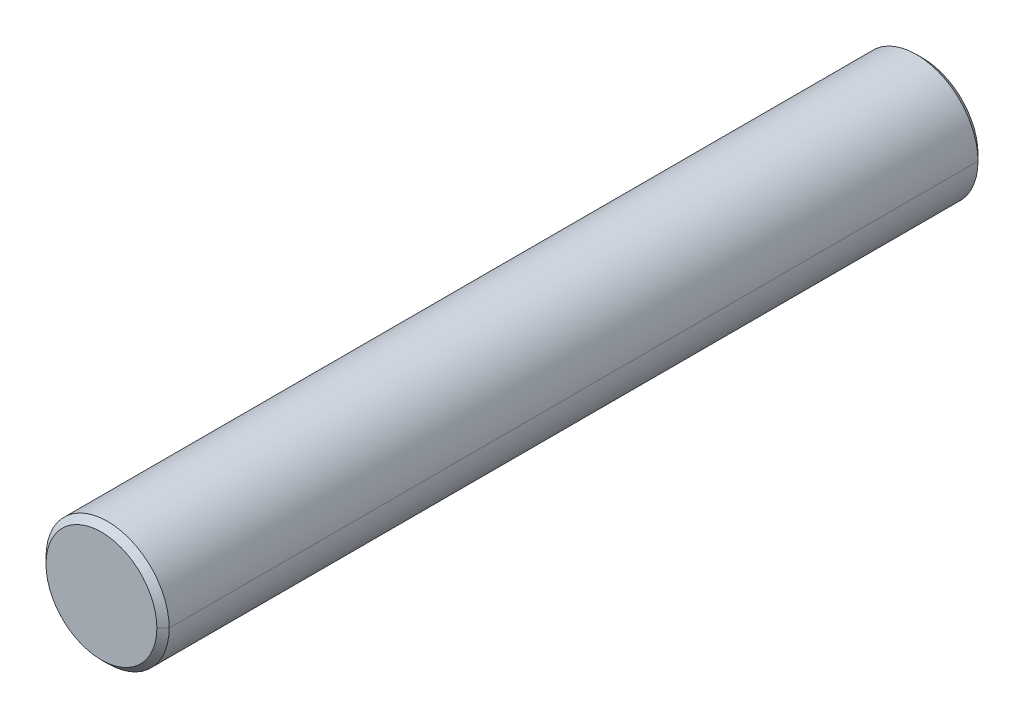
ISO-10303-21;
HEADER;
FILE_DESCRIPTION(('STEP AP214'),'2;1');
FILE_NAME('part.step','',(''),(''),'','','');
FILE_SCHEMA(('AUTOMOTIVE_DESIGN { 1 0 10303 214 1 1 1 1 }'));
ENDSEC;
DATA;
#1=APPLICATION_CONTEXT('core data for automotive mechanical design processes');
#2=APPLICATION_PROTOCOL_DEFINITION('international standard','automotive_design',2000,#1);
#3=PRODUCT_CONTEXT('',#1,'mechanical');
#4=PRODUCT('Part','Part','',(#3));
#5=PRODUCT_RELATED_PRODUCT_CATEGORY('part','',(#4));
#6=PRODUCT_DEFINITION_FORMATION('','',#4);
#7=PRODUCT_DEFINITION_CONTEXT('part definition',#1,'design');
#8=PRODUCT_DEFINITION('design','',#6,#7);
#9=PRODUCT_DEFINITION_SHAPE('','',#8);
#10=(LENGTH_UNIT() NAMED_UNIT(*) SI_UNIT(.MILLI.,.METRE.));
#11=(NAMED_UNIT(*) PLANE_ANGLE_UNIT() SI_UNIT($,.RADIAN.));
#12=(NAMED_UNIT(*) SI_UNIT($,.STERADIAN.) SOLID_ANGLE_UNIT());
#13=UNCERTAINTY_MEASURE_WITH_UNIT(LENGTH_MEASURE(1.E-05),#10,'distance_accuracy_value','');
#14=(GEOMETRIC_REPRESENTATION_CONTEXT(3) GLOBAL_UNCERTAINTY_ASSIGNED_CONTEXT((#13)) GLOBAL_UNIT_ASSIGNED_CONTEXT((#10,
#11,#12)) REPRESENTATION_CONTEXT('',''));
#15=CARTESIAN_POINT('',(0.,0.,0.));
#16=DIRECTION('',(0.,0.,1.));
#17=DIRECTION('',(1.,0.,0.));
#18=AXIS2_PLACEMENT_3D('',#15,#16,#17);
#19=CARTESIAN_POINT('',(0.,0.,-10.));
#20=DIRECTION('',(0.,0.,1.));
#21=DIRECTION('',(1.,0.,0.));
#22=AXIS2_PLACEMENT_3D('',#19,#20,#21);
#23=PLANE('',#22);
#24=CARTESIAN_POINT('',(0.,0.,-10.));
#25=DIRECTION('',(0.,0.,-1.));
#26=DIRECTION('',(1.,0.,0.));
#27=AXIS2_PLACEMENT_3D('',#24,#25,#26);
#28=CIRCLE('',#27,1.35);
#29=CARTESIAN_POINT('',(1.35,0.,-10.));
#30=VERTEX_POINT('',#29);
#31=CARTESIAN_POINT('',(-1.35,0.,-10.));
#32=VERTEX_POINT('',#31);
#33=EDGE_CURVE('E11',#30,#32,#28,.T.);
#34=ORIENTED_EDGE('',*,*,#33,.T.);
#35=CARTESIAN_POINT('',(0.,0.,-10.));
#36=DIRECTION('',(0.,0.,-1.));
#37=DIRECTION('',(1.,0.,0.));
#38=AXIS2_PLACEMENT_3D('',#35,#36,#37);
#39=CIRCLE('',#38,1.35);
#40=EDGE_CURVE('E113',#32,#30,#39,.T.);
#41=ORIENTED_EDGE('',*,*,#40,.T.);
#42=EDGE_LOOP('',(#34,#41));
#43=FACE_BOUND('',#42,.T.);
#44=ADVANCED_FACE('F17',(#43),#23,.F.);
#45=CARTESIAN_POINT('',(0.,0.,-9.85));
#46=DIRECTION('',(0.,0.,1.));
#47=DIRECTION('',(1.,0.,0.));
#48=AXIS2_PLACEMENT_3D('',#45,#46,#47);
#49=CONICAL_SURFACE('',#48,1.5,0.785398163397);
#50=DIRECTION('',(-0.707106781186548,0.,0.707106781186548));
#51=VECTOR('',#50,1.);
#52=CARTESIAN_POINT('',(-3535534.65593,4.32978119966E-10,3535523.30593));
#53=LINE('',#52,#51);
#54=CARTESIAN_POINT('',(-1.5,0.,-9.85));
#55=VERTEX_POINT('',#54);
#56=EDGE_CURVE('E21',#32,#55,#53,.T.);
#57=ORIENTED_EDGE('',*,*,#56,.F.);
#58=ORIENTED_EDGE('',*,*,#33,.F.);
#59=DIRECTION('',(0.707106781186548,0.,0.707106781186548));
#60=VECTOR('',#59,1.);
#61=CARTESIAN_POINT('',(3535534.65593,0.,3535523.30593));
#62=LINE('',#61,#60);
#63=CARTESIAN_POINT('',(1.5,0.,-9.85));
#64=VERTEX_POINT('',#63);
#65=EDGE_CURVE('E27',#30,#64,#62,.T.);
#66=ORIENTED_EDGE('',*,*,#65,.T.);
#67=CARTESIAN_POINT('',(0.,0.,-9.84999999963));
#68=DIRECTION('',(0.,0.,1.));
#69=DIRECTION('',(1.,0.,0.));
#70=AXIS2_PLACEMENT_3D('',#67,#68,#69);
#71=CIRCLE('',#70,1.5);
#72=EDGE_CURVE('E84',#55,#64,#71,.T.);
#73=ORIENTED_EDGE('',*,*,#72,.F.);
#74=EDGE_LOOP('',(#57,#58,#66,#73));
#75=FACE_BOUND('',#74,.T.);
#76=ADVANCED_FACE('F134',(#75),#49,.T.);
#77=CARTESIAN_POINT('',(0.,0.,-9.85));
#78=DIRECTION('',(0.,0.,1.));
#79=DIRECTION('',(1.,0.,0.));
#80=AXIS2_PLACEMENT_3D('',#77,#78,#79);
#81=CONICAL_SURFACE('',#80,1.5,0.785398163397);
#82=ORIENTED_EDGE('',*,*,#40,.F.);
#83=ORIENTED_EDGE('',*,*,#56,.T.);
#84=CARTESIAN_POINT('',(0.,0.,-9.84999999963));
#85=DIRECTION('',(0.,0.,1.));
#86=DIRECTION('',(1.,0.,0.));
#87=AXIS2_PLACEMENT_3D('',#84,#85,#86);
#88=CIRCLE('',#87,1.5);
#89=EDGE_CURVE('E80',#64,#55,#88,.T.);
#90=ORIENTED_EDGE('',*,*,#89,.F.);
#91=ORIENTED_EDGE('',*,*,#65,.F.);
#92=EDGE_LOOP('',(#82,#83,#90,#91));
#93=FACE_BOUND('',#92,.T.);
#94=ADVANCED_FACE('F133',(#93),#81,.T.);
#95=CARTESIAN_POINT('',(0.,0.,10.));
#96=DIRECTION('',(0.,0.,-1.));
#97=DIRECTION('',(-1.,0.,0.));
#98=AXIS2_PLACEMENT_3D('',#95,#96,#97);
#99=CYLINDRICAL_SURFACE('',#98,1.5);
#100=DIRECTION('',(0.,0.,-1.));
#101=VECTOR('',#100,1.);
#102=CARTESIAN_POINT('',(1.5,0.,10.));
#103=LINE('',#102,#101);
#104=CARTESIAN_POINT('',(1.5,0.,9.85));
#105=VERTEX_POINT('',#104);
#106=EDGE_CURVE('E89',#105,#64,#103,.T.);
#107=ORIENTED_EDGE('',*,*,#106,.F.);
#108=CARTESIAN_POINT('',(0.,0.,9.85));
#109=DIRECTION('',(0.,0.,-1.));
#110=DIRECTION('',(1.,0.,0.));
#111=AXIS2_PLACEMENT_3D('',#108,#109,#110);
#112=CIRCLE('',#111,1.5);
#113=CARTESIAN_POINT('',(-1.5,0.,9.85));
#114=VERTEX_POINT('',#113);
#115=EDGE_CURVE('E87',#105,#114,#112,.T.);
#116=ORIENTED_EDGE('',*,*,#115,.T.);
#117=DIRECTION('',(0.,0.,-1.));
#118=VECTOR('',#117,1.);
#119=CARTESIAN_POINT('',(-1.5,0.,10.));
#120=LINE('',#119,#118);
#121=EDGE_CURVE('E72',#114,#55,#120,.T.);
#122=ORIENTED_EDGE('',*,*,#121,.T.);
#123=ORIENTED_EDGE('',*,*,#72,.T.);
#124=EDGE_LOOP('',(#107,#116,#122,#123));
#125=FACE_BOUND('',#124,.T.);
#126=ADVANCED_FACE('F19',(#125),#99,.T.);
#127=CARTESIAN_POINT('',(0.,0.,10.));
#128=DIRECTION('',(0.,0.,-1.));
#129=DIRECTION('',(-1.,0.,0.));
#130=AXIS2_PLACEMENT_3D('',#127,#128,#129);
#131=CYLINDRICAL_SURFACE('',#130,1.5);
#132=CARTESIAN_POINT('',(0.,0.,9.85));
#133=DIRECTION('',(0.,0.,-1.));
#134=DIRECTION('',(1.,0.,0.));
#135=AXIS2_PLACEMENT_3D('',#132,#133,#134);
#136=CIRCLE('',#135,1.5);
#137=EDGE_CURVE('E77',#114,#105,#136,.T.);
#138=ORIENTED_EDGE('',*,*,#137,.T.);
#139=ORIENTED_EDGE('',*,*,#106,.T.);
#140=ORIENTED_EDGE('',*,*,#89,.T.);
#141=ORIENTED_EDGE('',*,*,#121,.F.);
#142=EDGE_LOOP('',(#138,#139,#140,#141));
#143=FACE_BOUND('',#142,.T.);
#144=ADVANCED_FACE('F74',(#143),#131,.T.);
#145=CARTESIAN_POINT('',(0.,0.,10.));
#146=DIRECTION('',(0.,0.,-1.));
#147=DIRECTION('',(-1.,0.,0.));
#148=AXIS2_PLACEMENT_3D('',#145,#146,#147);
#149=CONICAL_SURFACE('',#148,1.35,0.785398163397);
#150=DIRECTION('',(0.707106781186548,0.,-0.707106781186548));
#151=VECTOR('',#150,1.);
#152=CARTESIAN_POINT('',(3535534.58093,4.32978110781E-10,-3535523.23093));
#153=LINE('',#152,#151);
#154=CARTESIAN_POINT('',(1.35,0.,10.));
#155=VERTEX_POINT('',#154);
#156=EDGE_CURVE('E104',#155,#105,#153,.T.);
#157=ORIENTED_EDGE('',*,*,#156,.F.);
#158=CARTESIAN_POINT('',(0.,0.,10.));
#159=DIRECTION('',(0.,0.,1.));
#160=DIRECTION('',(1.,0.,0.));
#161=AXIS2_PLACEMENT_3D('',#158,#159,#160);
#162=CIRCLE('',#161,1.34999999963);
#163=CARTESIAN_POINT('',(-1.35,0.,10.));
#164=VERTEX_POINT('',#163);
#165=EDGE_CURVE('E93',#164,#155,#162,.T.);
#166=ORIENTED_EDGE('',*,*,#165,.F.);
#167=DIRECTION('',(-0.707106781186548,0.,-0.707106781186548));
#168=VECTOR('',#167,1.);
#169=CARTESIAN_POINT('',(-3535534.58093,0.,-3535523.23093));
#170=LINE('',#169,#168);
#171=EDGE_CURVE('E96',#164,#114,#170,.T.);
#172=ORIENTED_EDGE('',*,*,#171,.T.);
#173=ORIENTED_EDGE('',*,*,#115,.F.);
#174=EDGE_LOOP('',(#157,#166,#172,#173));
#175=FACE_BOUND('',#174,.T.);
#176=ADVANCED_FACE('F97',(#175),#149,.T.);
#177=CARTESIAN_POINT('',(0.,0.,10.));
#178=DIRECTION('',(0.,0.,1.));
#179=DIRECTION('',(1.,0.,0.));
#180=AXIS2_PLACEMENT_3D('',#177,#178,#179);
#181=PLANE('',#180);
#182=ORIENTED_EDGE('',*,*,#165,.T.);
#183=CARTESIAN_POINT('',(0.,0.,10.));
#184=DIRECTION('',(0.,0.,1.));
#185=DIRECTION('',(1.,0.,0.));
#186=AXIS2_PLACEMENT_3D('',#183,#184,#185);
#187=CIRCLE('',#186,1.35);
#188=EDGE_CURVE('E110',#155,#164,#187,.T.);
#189=ORIENTED_EDGE('',*,*,#188,.T.);
#190=EDGE_LOOP('',(#182,#189));
#191=FACE_BOUND('',#190,.T.);
#192=ADVANCED_FACE('F147',(#191),#181,.T.);
#193=CARTESIAN_POINT('',(0.,0.,10.));
#194=DIRECTION('',(0.,0.,-1.));
#195=DIRECTION('',(-1.,0.,0.));
#196=AXIS2_PLACEMENT_3D('',#193,#194,#195);
#197=CONICAL_SURFACE('',#196,1.35,0.785398163397);
#198=ORIENTED_EDGE('',*,*,#188,.F.);
#199=ORIENTED_EDGE('',*,*,#156,.T.);
#200=ORIENTED_EDGE('',*,*,#137,.F.);
#201=ORIENTED_EDGE('',*,*,#171,.F.);
#202=EDGE_LOOP('',(#198,#199,#200,#201));
#203=FACE_BOUND('',#202,.T.);
#204=ADVANCED_FACE('F103',(#203),#197,.T.);
#205=CLOSED_SHELL('',(#44,#76,#94,#126,#144,#176,#192,#204));
#206=MANIFOLD_SOLID_BREP('B1',#205);
#207=ADVANCED_BREP_SHAPE_REPRESENTATION('',(#18,#206),#14);
#208=SHAPE_DEFINITION_REPRESENTATION(#9,#207);
ENDSEC;
END-ISO-10303-21;
